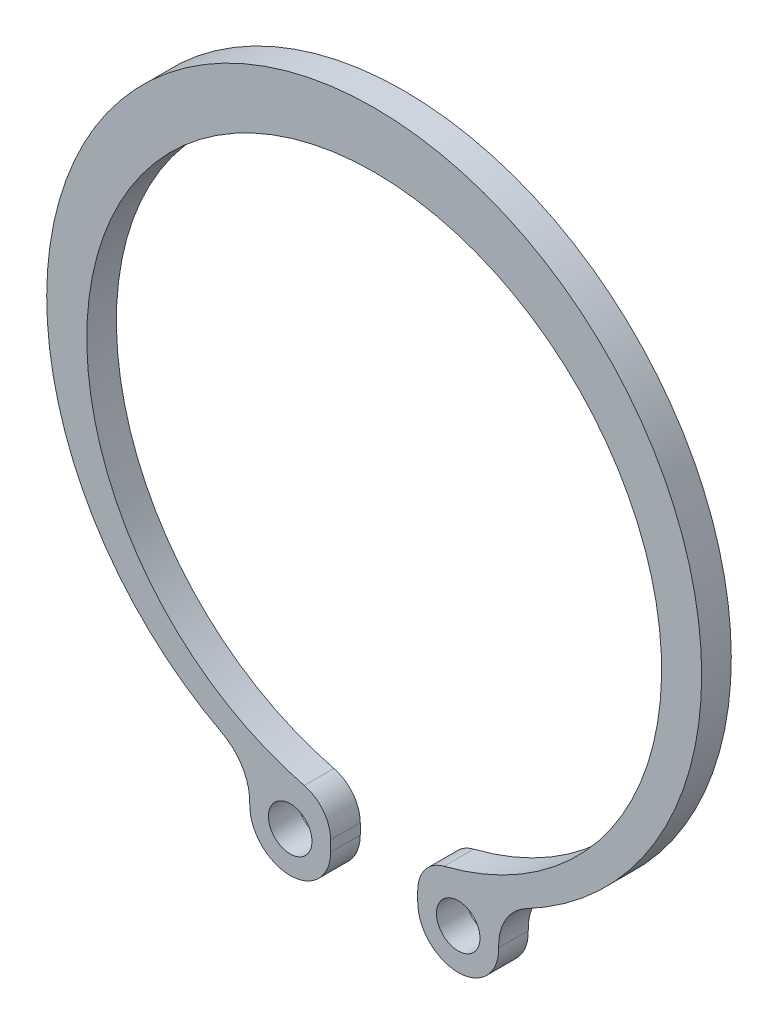
ISO-10303-21;
HEADER;
FILE_DESCRIPTION(('STEP AP214'),'2;1');
FILE_NAME('part.step','',(''),(''),'','','');
FILE_SCHEMA(('AUTOMOTIVE_DESIGN { 1 0 10303 214 1 1 1 1 }'));
ENDSEC;
DATA;
#1=APPLICATION_CONTEXT('core data for automotive mechanical design processes');
#2=APPLICATION_PROTOCOL_DEFINITION('international standard','automotive_design',2000,#1);
#3=PRODUCT_CONTEXT('',#1,'mechanical');
#4=PRODUCT('Part','Part','',(#3));
#5=PRODUCT_RELATED_PRODUCT_CATEGORY('part','',(#4));
#6=PRODUCT_DEFINITION_FORMATION('','',#4);
#7=PRODUCT_DEFINITION_CONTEXT('part definition',#1,'design');
#8=PRODUCT_DEFINITION('design','',#6,#7);
#9=PRODUCT_DEFINITION_SHAPE('','',#8);
#10=(LENGTH_UNIT() NAMED_UNIT(*) SI_UNIT(.MILLI.,.METRE.));
#11=(NAMED_UNIT(*) PLANE_ANGLE_UNIT() SI_UNIT($,.RADIAN.));
#12=(NAMED_UNIT(*) SI_UNIT($,.STERADIAN.) SOLID_ANGLE_UNIT());
#13=UNCERTAINTY_MEASURE_WITH_UNIT(LENGTH_MEASURE(1.E-05),#10,'distance_accuracy_value','');
#14=(GEOMETRIC_REPRESENTATION_CONTEXT(3) GLOBAL_UNCERTAINTY_ASSIGNED_CONTEXT((#13)) GLOBAL_UNIT_ASSIGNED_CONTEXT((#10,
#11,#12)) REPRESENTATION_CONTEXT('',''));
#15=CARTESIAN_POINT('',(0.,0.,0.));
#16=DIRECTION('',(0.,0.,1.));
#17=DIRECTION('',(1.,0.,0.));
#18=AXIS2_PLACEMENT_3D('',#15,#16,#17);
#19=CARTESIAN_POINT('',(4.5,-18.8443584449264,1.7));
#20=DIRECTION('',(0.,0.,1.));
#21=DIRECTION('',(1.,0.,0.));
#22=AXIS2_PLACEMENT_3D('',#19,#20,#21);
#23=PLANE('',#22);
#24=CARTESIAN_POINT('',(-4.82235881355856,-19.4614325133916,1.7));
#25=DIRECTION('',(0.,0.,1.));
#26=DIRECTION('',(1.,0.,0.));
#27=AXIS2_PLACEMENT_3D('',#24,#25,#26);
#28=CIRCLE('',#27,1.25);
#29=CARTESIAN_POINT('',(-3.57235881355856,-19.4614325133916,1.7));
#30=VERTEX_POINT('',#29);
#31=EDGE_CURVE('E148',#30,#30,#28,.T.);
#32=ORIENTED_EDGE('',*,*,#31,.F.);
#33=EDGE_LOOP('',(#32));
#34=FACE_BOUND('',#33,.T.);
#35=CARTESIAN_POINT('',(4.5,-18.8443584449264,1.7));
#36=DIRECTION('',(0.,0.,1.));
#37=DIRECTION('',(1.,0.,0.));
#38=AXIS2_PLACEMENT_3D('',#35,#36,#37);
#39=CIRCLE('',#38,2.);
#40=CARTESIAN_POINT('',(4.0135135135135,-16.9044278022316,1.7));
#41=VERTEX_POINT('',#40);
#42=CARTESIAN_POINT('',(2.5,-18.8443584449264,1.7));
#43=VERTEX_POINT('',#42);
#44=EDGE_CURVE('E163',#41,#43,#39,.T.);
#45=ORIENTED_EDGE('',*,*,#44,.T.);
#46=DIRECTION('',(0.,-1.,0.));
#47=VECTOR('',#46,1.);
#48=CARTESIAN_POINT('',(2.5,-19.4614325133916,1.7));
#49=LINE('',#48,#47);
#50=CARTESIAN_POINT('',(2.5,-19.4614325133916,1.7));
#51=VERTEX_POINT('',#50);
#52=EDGE_CURVE('E101',#43,#51,#49,.T.);
#53=ORIENTED_EDGE('',*,*,#52,.T.);
#54=CARTESIAN_POINT('',(4.82235881355856,-19.4614325133916,1.7));
#55=DIRECTION('',(0.,0.,1.));
#56=DIRECTION('',(-1.,0.,0.));
#57=AXIS2_PLACEMENT_3D('',#54,#55,#56);
#58=CIRCLE('',#57,2.32235881355856);
#59=CARTESIAN_POINT('',(7.14360973976197,-19.3897066706784,1.7));
#60=VERTEX_POINT('',#59);
#61=EDGE_CURVE('E184',#51,#60,#58,.T.);
#62=ORIENTED_EDGE('',*,*,#61,.T.);
#63=CARTESIAN_POINT('',(10.1421785819038,-19.2970519409772,1.7));
#64=DIRECTION('',(0.,0.,-1.));
#65=DIRECTION('',(1.,0.,0.));
#66=AXIS2_PLACEMENT_3D('',#63,#64,#65);
#67=CIRCLE('',#66,3.);
#68=CARTESIAN_POINT('',(8.74646593301798,-16.6414943344207,1.7));
#69=VERTEX_POINT('',#68);
#70=EDGE_CURVE('E203',#60,#69,#67,.T.);
#71=ORIENTED_EDGE('',*,*,#70,.T.);
#72=CARTESIAN_POINT('',(0.,0.,1.7));
#73=DIRECTION('',(0.,0.,1.));
#74=DIRECTION('',(1.,0.,0.));
#75=AXIS2_PLACEMENT_3D('',#72,#73,#74);
#76=CIRCLE('',#75,18.8);
#77=CARTESIAN_POINT('',(-8.74646593301799,-16.6414943344207,1.7));
#78=VERTEX_POINT('',#77);
#79=EDGE_CURVE('E200',#69,#78,#76,.T.);
#80=ORIENTED_EDGE('',*,*,#79,.T.);
#81=CARTESIAN_POINT('',(-10.1421785819038,-19.2970519409772,1.7));
#82=DIRECTION('',(0.,0.,-1.));
#83=DIRECTION('',(-1.,0.,0.));
#84=AXIS2_PLACEMENT_3D('',#81,#82,#83);
#85=CIRCLE('',#84,3.);
#86=CARTESIAN_POINT('',(-7.14360973976197,-19.3897066706784,1.7));
#87=VERTEX_POINT('',#86);
#88=EDGE_CURVE('E202',#78,#87,#85,.T.);
#89=ORIENTED_EDGE('',*,*,#88,.T.);
#90=CARTESIAN_POINT('',(-4.82235881355856,-19.4614325133916,1.7));
#91=DIRECTION('',(0.,0.,1.));
#92=DIRECTION('',(1.,0.,0.));
#93=AXIS2_PLACEMENT_3D('',#90,#91,#92);
#94=CIRCLE('',#93,2.32235881355856);
#95=CARTESIAN_POINT('',(-2.5,-19.4614325133916,1.7));
#96=VERTEX_POINT('',#95);
#97=EDGE_CURVE('E126',#87,#96,#94,.T.);
#98=ORIENTED_EDGE('',*,*,#97,.T.);
#99=DIRECTION('',(0.,1.,0.));
#100=VECTOR('',#99,1.);
#101=CARTESIAN_POINT('',(-2.5,-19.4614325133916,1.7));
#102=LINE('',#101,#100);
#103=CARTESIAN_POINT('',(-2.5,-18.8443584449264,1.7));
#104=VERTEX_POINT('',#103);
#105=EDGE_CURVE('E120',#96,#104,#102,.T.);
#106=ORIENTED_EDGE('',*,*,#105,.T.);
#107=CARTESIAN_POINT('',(-4.5,-18.8443584449264,1.7));
#108=DIRECTION('',(0.,0.,1.));
#109=DIRECTION('',(-1.,0.,0.));
#110=AXIS2_PLACEMENT_3D('',#107,#108,#109);
#111=CIRCLE('',#110,2.);
#112=CARTESIAN_POINT('',(-4.01351351351351,-16.9044278022316,1.7));
#113=VERTEX_POINT('',#112);
#114=EDGE_CURVE('E124',#104,#113,#111,.T.);
#115=ORIENTED_EDGE('',*,*,#114,.T.);
#116=CARTESIAN_POINT('',(0.,-0.9,1.7));
#117=DIRECTION('',(0.,0.,-1.));
#118=DIRECTION('',(1.,0.,0.));
#119=AXIS2_PLACEMENT_3D('',#116,#117,#118);
#120=CIRCLE('',#119,16.5);
#121=EDGE_CURVE('E52',#113,#41,#120,.T.);
#122=ORIENTED_EDGE('',*,*,#121,.T.);
#123=EDGE_LOOP('',(#45,#53,#62,#71,#80,#89,#98,#106,#115,#122));
#124=FACE_BOUND('',#123,.T.);
#125=CARTESIAN_POINT('',(4.82235881355856,-19.4614325133916,1.7));
#126=DIRECTION('',(0.,0.,1.));
#127=DIRECTION('',(-1.,0.,0.));
#128=AXIS2_PLACEMENT_3D('',#125,#126,#127);
#129=CIRCLE('',#128,1.25);
#130=CARTESIAN_POINT('',(3.57235881355856,-19.4614325133916,1.7));
#131=VERTEX_POINT('',#130);
#132=EDGE_CURVE('E214',#131,#131,#129,.T.);
#133=ORIENTED_EDGE('',*,*,#132,.F.);
#134=EDGE_LOOP('',(#133));
#135=FACE_BOUND('',#134,.T.);
#136=ADVANCED_FACE('F35',(#34,#124,#135),#23,.T.);
#137=CARTESIAN_POINT('',(4.5,-18.8443584449264,0.));
#138=DIRECTION('',(0.,0.,1.));
#139=DIRECTION('',(1.,0.,0.));
#140=AXIS2_PLACEMENT_3D('',#137,#138,#139);
#141=PLANE('',#140);
#142=CARTESIAN_POINT('',(4.5,-18.8443584449264,0.));
#143=DIRECTION('',(0.,0.,1.));
#144=DIRECTION('',(1.,0.,0.));
#145=AXIS2_PLACEMENT_3D('',#142,#143,#144);
#146=CIRCLE('',#145,2.);
#147=CARTESIAN_POINT('',(4.0135135135135,-16.9044278022316,0.));
#148=VERTEX_POINT('',#147);
#149=CARTESIAN_POINT('',(2.5,-18.8443584449264,0.));
#150=VERTEX_POINT('',#149);
#151=EDGE_CURVE('E144',#148,#150,#146,.T.);
#152=ORIENTED_EDGE('',*,*,#151,.F.);
#153=CARTESIAN_POINT('',(0.,-0.9,0.));
#154=DIRECTION('',(0.,0.,-1.));
#155=DIRECTION('',(1.,0.,0.));
#156=AXIS2_PLACEMENT_3D('',#153,#154,#155);
#157=CIRCLE('',#156,16.5);
#158=CARTESIAN_POINT('',(-4.01351351351351,-16.9044278022316,0.));
#159=VERTEX_POINT('',#158);
#160=EDGE_CURVE('E93',#159,#148,#157,.T.);
#161=ORIENTED_EDGE('',*,*,#160,.F.);
#162=CARTESIAN_POINT('',(-4.5,-18.8443584449264,0.));
#163=DIRECTION('',(0.,0.,1.));
#164=DIRECTION('',(-1.,0.,0.));
#165=AXIS2_PLACEMENT_3D('',#162,#163,#164);
#166=CIRCLE('',#165,2.);
#167=CARTESIAN_POINT('',(-2.5,-18.8443584449264,0.));
#168=VERTEX_POINT('',#167);
#169=EDGE_CURVE('E87',#168,#159,#166,.T.);
#170=ORIENTED_EDGE('',*,*,#169,.F.);
#171=DIRECTION('',(0.,1.,0.));
#172=VECTOR('',#171,1.);
#173=CARTESIAN_POINT('',(-2.5,-19.4614325133916,0.));
#174=LINE('',#173,#172);
#175=CARTESIAN_POINT('',(-2.5,-19.4614325133916,0.));
#176=VERTEX_POINT('',#175);
#177=EDGE_CURVE('E134',#176,#168,#174,.T.);
#178=ORIENTED_EDGE('',*,*,#177,.F.);
#179=CARTESIAN_POINT('',(-4.82235881355856,-19.4614325133916,0.));
#180=DIRECTION('',(0.,0.,1.));
#181=DIRECTION('',(1.,0.,0.));
#182=AXIS2_PLACEMENT_3D('',#179,#180,#181);
#183=CIRCLE('',#182,2.32235881355856);
#184=CARTESIAN_POINT('',(-7.14360973976197,-19.3897066706784,0.));
#185=VERTEX_POINT('',#184);
#186=EDGE_CURVE('E158',#185,#176,#183,.T.);
#187=ORIENTED_EDGE('',*,*,#186,.F.);
#188=CARTESIAN_POINT('',(-10.1421785819038,-19.2970519409772,0.));
#189=DIRECTION('',(0.,0.,-1.));
#190=DIRECTION('',(-1.,0.,0.));
#191=AXIS2_PLACEMENT_3D('',#188,#189,#190);
#192=CIRCLE('',#191,3.);
#193=CARTESIAN_POINT('',(-8.74646593301799,-16.6414943344207,0.));
#194=VERTEX_POINT('',#193);
#195=EDGE_CURVE('E156',#194,#185,#192,.T.);
#196=ORIENTED_EDGE('',*,*,#195,.F.);
#197=CARTESIAN_POINT('',(0.,0.,0.));
#198=DIRECTION('',(0.,0.,1.));
#199=DIRECTION('',(1.,0.,0.));
#200=AXIS2_PLACEMENT_3D('',#197,#198,#199);
#201=CIRCLE('',#200,18.8);
#202=CARTESIAN_POINT('',(8.74646593301798,-16.6414943344207,0.));
#203=VERTEX_POINT('',#202);
#204=EDGE_CURVE('E154',#203,#194,#201,.T.);
#205=ORIENTED_EDGE('',*,*,#204,.F.);
#206=CARTESIAN_POINT('',(10.1421785819038,-19.2970519409772,0.));
#207=DIRECTION('',(0.,0.,-1.));
#208=DIRECTION('',(1.,0.,0.));
#209=AXIS2_PLACEMENT_3D('',#206,#207,#208);
#210=CIRCLE('',#209,3.);
#211=CARTESIAN_POINT('',(7.14360973976197,-19.3897066706784,0.));
#212=VERTEX_POINT('',#211);
#213=EDGE_CURVE('E152',#212,#203,#210,.T.);
#214=ORIENTED_EDGE('',*,*,#213,.F.);
#215=CARTESIAN_POINT('',(4.82235881355856,-19.4614325133916,0.));
#216=DIRECTION('',(0.,0.,1.));
#217=DIRECTION('',(-1.,0.,0.));
#218=AXIS2_PLACEMENT_3D('',#215,#216,#217);
#219=CIRCLE('',#218,2.32235881355856);
#220=CARTESIAN_POINT('',(2.5,-19.4614325133916,0.));
#221=VERTEX_POINT('',#220);
#222=EDGE_CURVE('E150',#221,#212,#219,.T.);
#223=ORIENTED_EDGE('',*,*,#222,.F.);
#224=DIRECTION('',(0.,-1.,0.));
#225=VECTOR('',#224,1.);
#226=CARTESIAN_POINT('',(2.5,-19.4614325133916,0.));
#227=LINE('',#226,#225);
#228=EDGE_CURVE('E147',#150,#221,#227,.T.);
#229=ORIENTED_EDGE('',*,*,#228,.F.);
#230=EDGE_LOOP('',(#152,#161,#170,#178,#187,#196,#205,#214,#223,#229));
#231=FACE_BOUND('',#230,.T.);
#232=CARTESIAN_POINT('',(-4.82235881355856,-19.4614325133916,0.));
#233=DIRECTION('',(0.,0.,1.));
#234=DIRECTION('',(1.,0.,0.));
#235=AXIS2_PLACEMENT_3D('',#232,#233,#234);
#236=CIRCLE('',#235,1.25);
#237=CARTESIAN_POINT('',(-3.57235881355856,-19.4614325133916,0.));
#238=VERTEX_POINT('',#237);
#239=EDGE_CURVE('E211',#238,#238,#236,.T.);
#240=ORIENTED_EDGE('',*,*,#239,.T.);
#241=EDGE_LOOP('',(#240));
#242=FACE_BOUND('',#241,.T.);
#243=CARTESIAN_POINT('',(4.82235881355856,-19.4614325133916,0.));
#244=DIRECTION('',(0.,0.,1.));
#245=DIRECTION('',(-1.,0.,0.));
#246=AXIS2_PLACEMENT_3D('',#243,#244,#245);
#247=CIRCLE('',#246,1.25);
#248=CARTESIAN_POINT('',(3.57235881355856,-19.4614325133916,0.));
#249=VERTEX_POINT('',#248);
#250=EDGE_CURVE('E217',#249,#249,#247,.T.);
#251=ORIENTED_EDGE('',*,*,#250,.T.);
#252=EDGE_LOOP('',(#251));
#253=FACE_BOUND('',#252,.T.);
#254=ADVANCED_FACE('F188',(#231,#242,#253),#141,.F.);
#255=CARTESIAN_POINT('',(4.5,-18.8443584449264,1.7));
#256=DIRECTION('',(0.,0.,-1.));
#257=DIRECTION('',(-1.,0.,0.));
#258=AXIS2_PLACEMENT_3D('',#255,#256,#257);
#259=CYLINDRICAL_SURFACE('',#258,2.);
#260=ORIENTED_EDGE('',*,*,#151,.T.);
#261=DIRECTION('',(0.,0.,-1.));
#262=VECTOR('',#261,1.);
#263=CARTESIAN_POINT('',(2.5,-18.8443584449264,1.7));
#264=LINE('',#263,#262);
#265=EDGE_CURVE('E11',#43,#150,#264,.T.);
#266=ORIENTED_EDGE('',*,*,#265,.F.);
#267=ORIENTED_EDGE('',*,*,#44,.F.);
#268=DIRECTION('',(0.,0.,-1.));
#269=VECTOR('',#268,1.);
#270=CARTESIAN_POINT('',(4.0135135135135,-16.9044278022316,1.7));
#271=LINE('',#270,#269);
#272=EDGE_CURVE('E140',#41,#148,#271,.T.);
#273=ORIENTED_EDGE('',*,*,#272,.T.);
#274=EDGE_LOOP('',(#260,#266,#267,#273));
#275=FACE_BOUND('',#274,.T.);
#276=ADVANCED_FACE('F37',(#275),#259,.T.);
#277=CARTESIAN_POINT('',(2.5,-19.4614325133916,1.7));
#278=DIRECTION('',(1.,0.,0.));
#279=DIRECTION('',(0.,1.,0.));
#280=AXIS2_PLACEMENT_3D('',#277,#278,#279);
#281=PLANE('',#280);
#282=ORIENTED_EDGE('',*,*,#228,.T.);
#283=DIRECTION('',(0.,0.,-1.));
#284=VECTOR('',#283,1.);
#285=CARTESIAN_POINT('',(2.5,-19.4614325133916,1.7));
#286=LINE('',#285,#284);
#287=EDGE_CURVE('E44',#51,#221,#286,.T.);
#288=ORIENTED_EDGE('',*,*,#287,.F.);
#289=ORIENTED_EDGE('',*,*,#52,.F.);
#290=ORIENTED_EDGE('',*,*,#265,.T.);
#291=EDGE_LOOP('',(#282,#288,#289,#290));
#292=FACE_BOUND('',#291,.T.);
#293=ADVANCED_FACE('F257',(#292),#281,.F.);
#294=CARTESIAN_POINT('',(4.82235881355856,-19.4614325133916,1.7));
#295=DIRECTION('',(0.,0.,-1.));
#296=DIRECTION('',(-1.,0.,0.));
#297=AXIS2_PLACEMENT_3D('',#294,#295,#296);
#298=CYLINDRICAL_SURFACE('',#297,2.32235881355856);
#299=ORIENTED_EDGE('',*,*,#222,.T.);
#300=DIRECTION('',(0.,0.,-1.));
#301=VECTOR('',#300,1.);
#302=CARTESIAN_POINT('',(7.14360973976197,-19.3897066706784,1.7));
#303=LINE('',#302,#301);
#304=EDGE_CURVE('E176',#60,#212,#303,.T.);
#305=ORIENTED_EDGE('',*,*,#304,.F.);
#306=ORIENTED_EDGE('',*,*,#61,.F.);
#307=ORIENTED_EDGE('',*,*,#287,.T.);
#308=EDGE_LOOP('',(#299,#305,#306,#307));
#309=FACE_BOUND('',#308,.T.);
#310=ADVANCED_FACE('F182',(#309),#298,.T.);
#311=CARTESIAN_POINT('',(10.1421785819038,-19.2970519409772,1.7));
#312=DIRECTION('',(0.,0.,-1.));
#313=DIRECTION('',(-1.,0.,0.));
#314=AXIS2_PLACEMENT_3D('',#311,#312,#313);
#315=CYLINDRICAL_SURFACE('',#314,3.);
#316=ORIENTED_EDGE('',*,*,#213,.T.);
#317=DIRECTION('',(0.,0.,-1.));
#318=VECTOR('',#317,1.);
#319=CARTESIAN_POINT('',(8.74646593301798,-16.6414943344207,1.7));
#320=LINE('',#319,#318);
#321=EDGE_CURVE('E173',#69,#203,#320,.T.);
#322=ORIENTED_EDGE('',*,*,#321,.F.);
#323=ORIENTED_EDGE('',*,*,#70,.F.);
#324=ORIENTED_EDGE('',*,*,#304,.T.);
#325=EDGE_LOOP('',(#316,#322,#323,#324));
#326=FACE_BOUND('',#325,.T.);
#327=ADVANCED_FACE('F194',(#326),#315,.F.);
#328=CARTESIAN_POINT('',(0.,0.,1.7));
#329=DIRECTION('',(0.,0.,-1.));
#330=DIRECTION('',(-1.,0.,0.));
#331=AXIS2_PLACEMENT_3D('',#328,#329,#330);
#332=CYLINDRICAL_SURFACE('',#331,18.8);
#333=ORIENTED_EDGE('',*,*,#204,.T.);
#334=DIRECTION('',(0.,0.,-1.));
#335=VECTOR('',#334,1.);
#336=CARTESIAN_POINT('',(-8.74646593301799,-16.6414943344207,1.7));
#337=LINE('',#336,#335);
#338=EDGE_CURVE('E170',#78,#194,#337,.T.);
#339=ORIENTED_EDGE('',*,*,#338,.F.);
#340=ORIENTED_EDGE('',*,*,#79,.F.);
#341=ORIENTED_EDGE('',*,*,#321,.T.);
#342=EDGE_LOOP('',(#333,#339,#340,#341));
#343=FACE_BOUND('',#342,.T.);
#344=ADVANCED_FACE('F198',(#343),#332,.T.);
#345=CARTESIAN_POINT('',(-10.1421785819038,-19.2970519409772,1.7));
#346=DIRECTION('',(0.,0.,-1.));
#347=DIRECTION('',(-1.,0.,0.));
#348=AXIS2_PLACEMENT_3D('',#345,#346,#347);
#349=CYLINDRICAL_SURFACE('',#348,3.);
#350=ORIENTED_EDGE('',*,*,#195,.T.);
#351=DIRECTION('',(0.,0.,-1.));
#352=VECTOR('',#351,1.);
#353=CARTESIAN_POINT('',(-7.14360973976197,-19.3897066706784,1.7));
#354=LINE('',#353,#352);
#355=EDGE_CURVE('E167',#87,#185,#354,.T.);
#356=ORIENTED_EDGE('',*,*,#355,.F.);
#357=ORIENTED_EDGE('',*,*,#88,.F.);
#358=ORIENTED_EDGE('',*,*,#338,.T.);
#359=EDGE_LOOP('',(#350,#356,#357,#358));
#360=FACE_BOUND('',#359,.T.);
#361=ADVANCED_FACE('F247',(#360),#349,.F.);
#362=CARTESIAN_POINT('',(-4.82235881355856,-19.4614325133916,1.7));
#363=DIRECTION('',(0.,0.,-1.));
#364=DIRECTION('',(-1.,0.,0.));
#365=AXIS2_PLACEMENT_3D('',#362,#363,#364);
#366=CYLINDRICAL_SURFACE('',#365,2.32235881355856);
#367=ORIENTED_EDGE('',*,*,#186,.T.);
#368=DIRECTION('',(0.,0.,-1.));
#369=VECTOR('',#368,1.);
#370=CARTESIAN_POINT('',(-2.5,-19.4614325133916,1.7));
#371=LINE('',#370,#369);
#372=EDGE_CURVE('E135',#96,#176,#371,.T.);
#373=ORIENTED_EDGE('',*,*,#372,.F.);
#374=ORIENTED_EDGE('',*,*,#97,.F.);
#375=ORIENTED_EDGE('',*,*,#355,.T.);
#376=EDGE_LOOP('',(#367,#373,#374,#375));
#377=FACE_BOUND('',#376,.T.);
#378=ADVANCED_FACE('F244',(#377),#366,.T.);
#379=CARTESIAN_POINT('',(-2.5,-19.4614325133916,1.7));
#380=DIRECTION('',(-1.,0.,0.));
#381=DIRECTION('',(0.,-1.,0.));
#382=AXIS2_PLACEMENT_3D('',#379,#380,#381);
#383=PLANE('',#382);
#384=ORIENTED_EDGE('',*,*,#177,.T.);
#385=DIRECTION('',(0.,0.,-1.));
#386=VECTOR('',#385,1.);
#387=CARTESIAN_POINT('',(-2.5,-18.8443584449264,1.7));
#388=LINE('',#387,#386);
#389=EDGE_CURVE('E131',#104,#168,#388,.T.);
#390=ORIENTED_EDGE('',*,*,#389,.F.);
#391=ORIENTED_EDGE('',*,*,#105,.F.);
#392=ORIENTED_EDGE('',*,*,#372,.T.);
#393=EDGE_LOOP('',(#384,#390,#391,#392));
#394=FACE_BOUND('',#393,.T.);
#395=ADVANCED_FACE('F132',(#394),#383,.F.);
#396=CARTESIAN_POINT('',(-4.5,-18.8443584449264,1.7));
#397=DIRECTION('',(0.,0.,-1.));
#398=DIRECTION('',(-1.,0.,0.));
#399=AXIS2_PLACEMENT_3D('',#396,#397,#398);
#400=CYLINDRICAL_SURFACE('',#399,2.);
#401=ORIENTED_EDGE('',*,*,#169,.T.);
#402=DIRECTION('',(0.,0.,-1.));
#403=VECTOR('',#402,1.);
#404=CARTESIAN_POINT('',(-4.01351351351351,-16.9044278022316,1.7));
#405=LINE('',#404,#403);
#406=EDGE_CURVE('E136',#113,#159,#405,.T.);
#407=ORIENTED_EDGE('',*,*,#406,.F.);
#408=ORIENTED_EDGE('',*,*,#114,.F.);
#409=ORIENTED_EDGE('',*,*,#389,.T.);
#410=EDGE_LOOP('',(#401,#407,#408,#409));
#411=FACE_BOUND('',#410,.T.);
#412=ADVANCED_FACE('F138',(#411),#400,.T.);
#413=CARTESIAN_POINT('',(0.,-0.9,1.7));
#414=DIRECTION('',(0.,0.,-1.));
#415=DIRECTION('',(-1.,0.,0.));
#416=AXIS2_PLACEMENT_3D('',#413,#414,#415);
#417=CYLINDRICAL_SURFACE('',#416,16.5);
#418=ORIENTED_EDGE('',*,*,#160,.T.);
#419=ORIENTED_EDGE('',*,*,#272,.F.);
#420=ORIENTED_EDGE('',*,*,#121,.F.);
#421=ORIENTED_EDGE('',*,*,#406,.T.);
#422=EDGE_LOOP('',(#418,#419,#420,#421));
#423=FACE_BOUND('',#422,.T.);
#424=ADVANCED_FACE('F237',(#423),#417,.F.);
#425=CARTESIAN_POINT('',(-4.82235881355856,-19.4614325133916,1.7));
#426=DIRECTION('',(0.,0.,-1.));
#427=DIRECTION('',(-1.,0.,0.));
#428=AXIS2_PLACEMENT_3D('',#425,#426,#427);
#429=CYLINDRICAL_SURFACE('',#428,1.25);
#430=ORIENTED_EDGE('',*,*,#31,.T.);
#431=EDGE_LOOP('',(#430));
#432=FACE_BOUND('',#431,.T.);
#433=ORIENTED_EDGE('',*,*,#239,.F.);
#434=EDGE_LOOP('',(#433));
#435=FACE_BOUND('',#434,.T.);
#436=ADVANCED_FACE('F234',(#432,#435),#429,.F.);
#437=CARTESIAN_POINT('',(4.82235881355856,-19.4614325133916,1.7));
#438=DIRECTION('',(0.,0.,-1.));
#439=DIRECTION('',(-1.,0.,0.));
#440=AXIS2_PLACEMENT_3D('',#437,#438,#439);
#441=CYLINDRICAL_SURFACE('',#440,1.25);
#442=ORIENTED_EDGE('',*,*,#132,.T.);
#443=EDGE_LOOP('',(#442));
#444=FACE_BOUND('',#443,.T.);
#445=ORIENTED_EDGE('',*,*,#250,.F.);
#446=EDGE_LOOP('',(#445));
#447=FACE_BOUND('',#446,.T.);
#448=ADVANCED_FACE('F223',(#444,#447),#441,.F.);
#449=CLOSED_SHELL('',(#136,#254,#276,#293,#310,#327,#344,#361,#378,#395,#412,#424,#436,#448));
#450=MANIFOLD_SOLID_BREP('B2',#449);
#451=ADVANCED_BREP_SHAPE_REPRESENTATION('',(#18,#450),#14);
#452=SHAPE_DEFINITION_REPRESENTATION(#9,#451);
ENDSEC;
END-ISO-10303-21;
